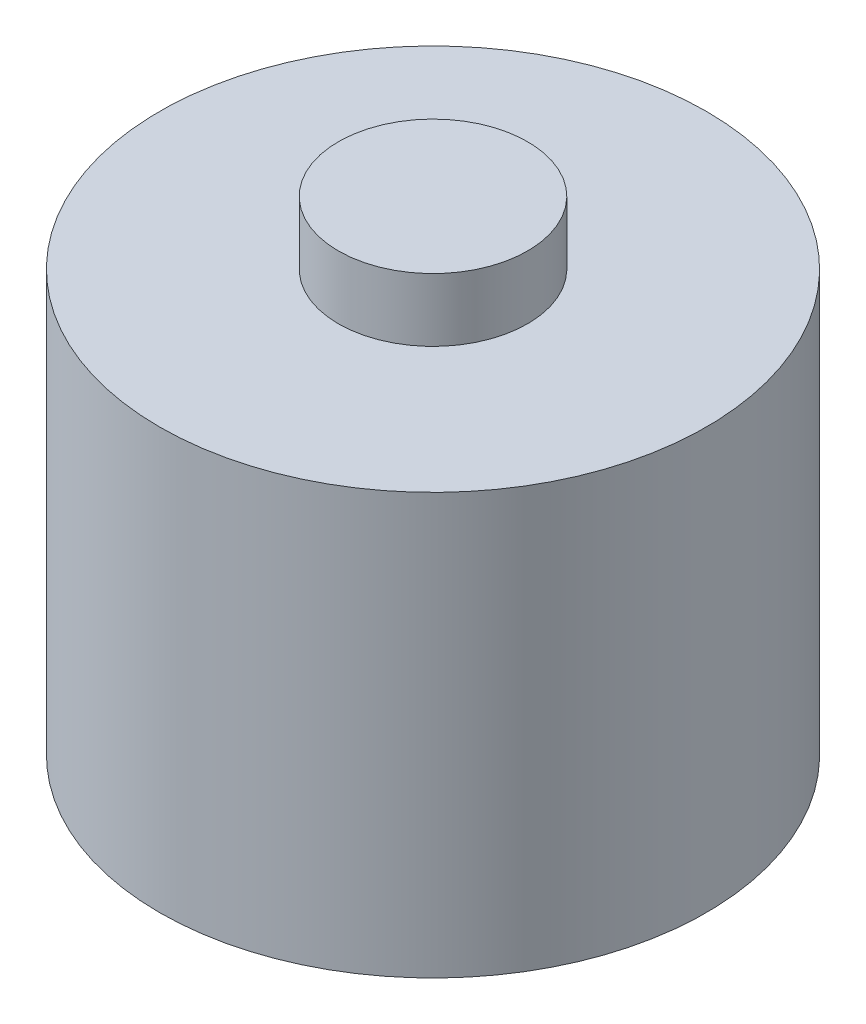
ISO-10303-21;
HEADER;
FILE_DESCRIPTION(('STEP AP214'),'2;1');
FILE_NAME('part.step','',(''),(''),'','','');
FILE_SCHEMA(('AUTOMOTIVE_DESIGN { 1 0 10303 214 1 1 1 1 }'));
ENDSEC;
DATA;
#1=APPLICATION_CONTEXT('core data for automotive mechanical design processes');
#2=APPLICATION_PROTOCOL_DEFINITION('international standard','automotive_design',2000,#1);
#3=PRODUCT_CONTEXT('',#1,'mechanical');
#4=PRODUCT('Part','Part','',(#3));
#5=PRODUCT_RELATED_PRODUCT_CATEGORY('part','',(#4));
#6=PRODUCT_DEFINITION_FORMATION('','',#4);
#7=PRODUCT_DEFINITION_CONTEXT('part definition',#1,'design');
#8=PRODUCT_DEFINITION('design','',#6,#7);
#9=PRODUCT_DEFINITION_SHAPE('','',#8);
#10=(LENGTH_UNIT() NAMED_UNIT(*) SI_UNIT(.MILLI.,.METRE.));
#11=(NAMED_UNIT(*) PLANE_ANGLE_UNIT() SI_UNIT($,.RADIAN.));
#12=(NAMED_UNIT(*) SI_UNIT($,.STERADIAN.) SOLID_ANGLE_UNIT());
#13=UNCERTAINTY_MEASURE_WITH_UNIT(LENGTH_MEASURE(1.E-05),#10,'distance_accuracy_value','');
#14=(GEOMETRIC_REPRESENTATION_CONTEXT(3) GLOBAL_UNCERTAINTY_ASSIGNED_CONTEXT((#13)) GLOBAL_UNIT_ASSIGNED_CONTEXT((#10,
#11,#12)) REPRESENTATION_CONTEXT('',''));
#15=CARTESIAN_POINT('',(0.,0.,0.));
#16=DIRECTION('',(0.,0.,1.));
#17=DIRECTION('',(1.,0.,0.));
#18=AXIS2_PLACEMENT_3D('',#15,#16,#17);
#19=CARTESIAN_POINT('',(0.,20.,0.));
#20=DIRECTION('',(0.,-1.,0.));
#21=DIRECTION('',(0.,0.,-1.));
#22=AXIS2_PLACEMENT_3D('',#19,#20,#21);
#23=CYLINDRICAL_SURFACE('',#22,13.);
#24=CARTESIAN_POINT('',(0.,20.,0.));
#25=DIRECTION('',(0.,1.,0.));
#26=DIRECTION('',(0.,0.,1.));
#27=AXIS2_PLACEMENT_3D('',#24,#25,#26);
#28=CIRCLE('',#27,13.);
#29=CARTESIAN_POINT('',(0.,20.,13.));
#30=VERTEX_POINT('',#29);
#31=EDGE_CURVE('E43',#30,#30,#28,.T.);
#32=ORIENTED_EDGE('',*,*,#31,.F.);
#33=EDGE_LOOP('',(#32));
#34=FACE_BOUND('',#33,.T.);
#35=CARTESIAN_POINT('',(0.,0.,0.));
#36=DIRECTION('',(0.,1.,0.));
#37=DIRECTION('',(0.,0.,1.));
#38=AXIS2_PLACEMENT_3D('',#35,#36,#37);
#39=CIRCLE('',#38,13.);
#40=CARTESIAN_POINT('',(0.,0.,13.));
#41=VERTEX_POINT('',#40);
#42=EDGE_CURVE('E38',#41,#41,#39,.T.);
#43=ORIENTED_EDGE('',*,*,#42,.T.);
#44=EDGE_LOOP('',(#43));
#45=FACE_BOUND('',#44,.T.);
#46=ADVANCED_FACE('F35',(#34,#45),#23,.T.);
#47=CARTESIAN_POINT('',(0.,20.,0.));
#48=DIRECTION('',(0.,1.,0.));
#49=DIRECTION('',(0.,0.,1.));
#50=AXIS2_PLACEMENT_3D('',#47,#48,#49);
#51=PLANE('',#50);
#52=CARTESIAN_POINT('',(0.,20.,0.));
#53=DIRECTION('',(0.,1.,0.));
#54=DIRECTION('',(0.,0.,1.));
#55=AXIS2_PLACEMENT_3D('',#52,#53,#54);
#56=CIRCLE('',#55,4.5);
#57=CARTESIAN_POINT('',(0.,20.,4.5));
#58=VERTEX_POINT('',#57);
#59=EDGE_CURVE('E10',#58,#58,#56,.T.);
#60=ORIENTED_EDGE('',*,*,#59,.F.);
#61=EDGE_LOOP('',(#60));
#62=FACE_BOUND('',#61,.T.);
#63=ORIENTED_EDGE('',*,*,#31,.T.);
#64=EDGE_LOOP('',(#63));
#65=FACE_BOUND('',#64,.T.);
#66=ADVANCED_FACE('F63',(#62,#65),#51,.T.);
#67=CARTESIAN_POINT('',(0.,0.,0.));
#68=DIRECTION('',(0.,1.,0.));
#69=DIRECTION('',(0.,0.,1.));
#70=AXIS2_PLACEMENT_3D('',#67,#68,#69);
#71=PLANE('',#70);
#72=ORIENTED_EDGE('',*,*,#42,.F.);
#73=EDGE_LOOP('',(#72));
#74=FACE_BOUND('',#73,.T.);
#75=ADVANCED_FACE('F60',(#74),#71,.F.);
#76=CARTESIAN_POINT('',(0.,23.,0.));
#77=DIRECTION('',(0.,-1.,0.));
#78=DIRECTION('',(0.,0.,-1.));
#79=AXIS2_PLACEMENT_3D('',#76,#77,#78);
#80=CYLINDRICAL_SURFACE('',#79,4.5);
#81=CARTESIAN_POINT('',(0.,23.,0.));
#82=DIRECTION('',(0.,1.,0.));
#83=DIRECTION('',(0.,0.,1.));
#84=AXIS2_PLACEMENT_3D('',#81,#82,#83);
#85=CIRCLE('',#84,4.5);
#86=CARTESIAN_POINT('',(0.,23.,4.5));
#87=VERTEX_POINT('',#86);
#88=EDGE_CURVE('E50',#87,#87,#85,.T.);
#89=ORIENTED_EDGE('',*,*,#88,.F.);
#90=EDGE_LOOP('',(#89));
#91=FACE_BOUND('',#90,.T.);
#92=ORIENTED_EDGE('',*,*,#59,.T.);
#93=EDGE_LOOP('',(#92));
#94=FACE_BOUND('',#93,.T.);
#95=ADVANCED_FACE('F62',(#91,#94),#80,.T.);
#96=CARTESIAN_POINT('',(0.,23.,0.));
#97=DIRECTION('',(0.,1.,0.));
#98=DIRECTION('',(0.,0.,1.));
#99=AXIS2_PLACEMENT_3D('',#96,#97,#98);
#100=PLANE('',#99);
#101=ORIENTED_EDGE('',*,*,#88,.T.);
#102=EDGE_LOOP('',(#101));
#103=FACE_BOUND('',#102,.T.);
#104=ADVANCED_FACE('F68',(#103),#100,.T.);
#105=CLOSED_SHELL('',(#46,#66,#75,#95,#104));
#106=MANIFOLD_SOLID_BREP('B2',#105);
#107=ADVANCED_BREP_SHAPE_REPRESENTATION('',(#18,#106),#14);
#108=SHAPE_DEFINITION_REPRESENTATION(#9,#107);
ENDSEC;
END-ISO-10303-21;
